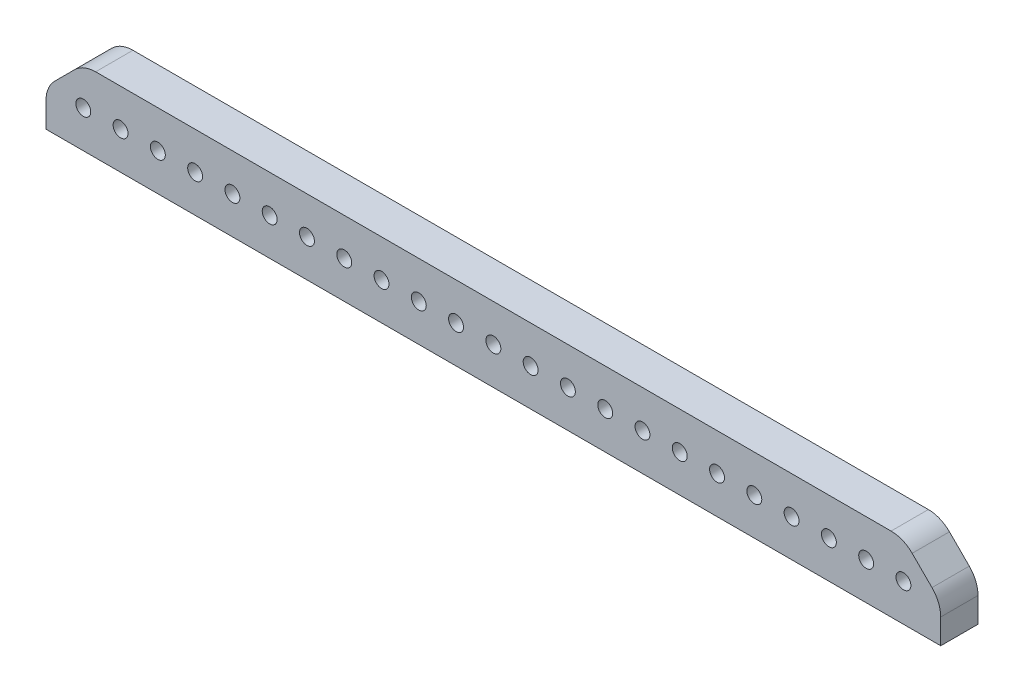
ISO-10303-21;
HEADER;
FILE_DESCRIPTION(('STEP AP214'),'2;1');
FILE_NAME('part.step','',(''),(''),'','','');
FILE_SCHEMA(('AUTOMOTIVE_DESIGN { 1 0 10303 214 1 1 1 1 }'));
ENDSEC;
DATA;
#1=APPLICATION_CONTEXT('core data for automotive mechanical design processes');
#2=APPLICATION_PROTOCOL_DEFINITION('international standard','automotive_design',2000,#1);
#3=PRODUCT_CONTEXT('',#1,'mechanical');
#4=PRODUCT('Part','Part','',(#3));
#5=PRODUCT_RELATED_PRODUCT_CATEGORY('part','',(#4));
#6=PRODUCT_DEFINITION_FORMATION('','',#4);
#7=PRODUCT_DEFINITION_CONTEXT('part definition',#1,'design');
#8=PRODUCT_DEFINITION('design','',#6,#7);
#9=PRODUCT_DEFINITION_SHAPE('','',#8);
#10=(LENGTH_UNIT() NAMED_UNIT(*) SI_UNIT(.MILLI.,.METRE.));
#11=(NAMED_UNIT(*) PLANE_ANGLE_UNIT() SI_UNIT($,.RADIAN.));
#12=(NAMED_UNIT(*) SI_UNIT($,.STERADIAN.) SOLID_ANGLE_UNIT());
#13=UNCERTAINTY_MEASURE_WITH_UNIT(LENGTH_MEASURE(1.E-05),#10,'distance_accuracy_value','');
#14=(GEOMETRIC_REPRESENTATION_CONTEXT(3) GLOBAL_UNCERTAINTY_ASSIGNED_CONTEXT((#13)) GLOBAL_UNIT_ASSIGNED_CONTEXT((#10,
#11,#12)) REPRESENTATION_CONTEXT('',''));
#15=CARTESIAN_POINT('',(0.,0.,0.));
#16=DIRECTION('',(0.,0.,1.));
#17=DIRECTION('',(1.,0.,0.));
#18=AXIS2_PLACEMENT_3D('',#15,#16,#17);
#19=CARTESIAN_POINT('',(76.2,-6.35,6.35));
#20=DIRECTION('',(-1.,0.,0.));
#21=DIRECTION('',(0.,0.,1.));
#22=AXIS2_PLACEMENT_3D('',#19,#20,#21);
#23=PLANE('',#22);
#24=DIRECTION('',(0.,1.,0.));
#25=VECTOR('',#24,1.);
#26=CARTESIAN_POINT('',(76.2,-6.35,0.));
#27=LINE('',#26,#25);
#28=CARTESIAN_POINT('',(76.2,-6.35,0.));
#29=VERTEX_POINT('',#28);
#30=CARTESIAN_POINT('',(76.2,-2.10420489685533,0.));
#31=VERTEX_POINT('',#30);
#32=EDGE_CURVE('E143',#29,#31,#27,.T.);
#33=ORIENTED_EDGE('',*,*,#32,.T.);
#34=DIRECTION('',(0.,0.,-1.));
#35=VECTOR('',#34,1.);
#36=CARTESIAN_POINT('',(76.2,-2.10420489685533,6.35));
#37=LINE('',#36,#35);
#38=CARTESIAN_POINT('',(76.2,-2.10420489685533,6.35));
#39=VERTEX_POINT('',#38);
#40=EDGE_CURVE('E11',#31,#39,#37,.F.);
#41=ORIENTED_EDGE('',*,*,#40,.T.);
#42=DIRECTION('',(0.,1.,0.));
#43=VECTOR('',#42,1.);
#44=CARTESIAN_POINT('',(76.2,-6.35,6.35));
#45=LINE('',#44,#43);
#46=CARTESIAN_POINT('',(76.2,-6.35,6.35));
#47=VERTEX_POINT('',#46);
#48=EDGE_CURVE('E151',#47,#39,#45,.T.);
#49=ORIENTED_EDGE('',*,*,#48,.F.);
#50=DIRECTION('',(0.,0.,-1.));
#51=VECTOR('',#50,1.);
#52=CARTESIAN_POINT('',(76.2,-6.35,6.35));
#53=LINE('',#52,#51);
#54=EDGE_CURVE('E134',#47,#29,#53,.T.);
#55=ORIENTED_EDGE('',*,*,#54,.T.);
#56=EDGE_LOOP('',(#33,#41,#49,#55));
#57=FACE_BOUND('',#56,.T.);
#58=ADVANCED_FACE('F33',(#57),#23,.F.);
#59=CARTESIAN_POINT('',(-76.2,6.35,6.35));
#60=DIRECTION('',(0.,-1.,0.));
#61=DIRECTION('',(0.,0.,-1.));
#62=AXIS2_PLACEMENT_3D('',#59,#60,#61);
#63=PLANE('',#62);
#64=DIRECTION('',(-1.,0.,0.));
#65=VECTOR('',#64,1.);
#66=CARTESIAN_POINT('',(-76.2,6.35,0.));
#67=LINE('',#66,#65);
#68=CARTESIAN_POINT('',(67.7457951031446,6.35,0.));
#69=VERTEX_POINT('',#68);
#70=CARTESIAN_POINT('',(-67.7457951031447,6.35,0.));
#71=VERTEX_POINT('',#70);
#72=EDGE_CURVE('E145',#69,#71,#67,.T.);
#73=ORIENTED_EDGE('',*,*,#72,.T.);
#74=DIRECTION('',(0.,0.,-1.));
#75=VECTOR('',#74,1.);
#76=CARTESIAN_POINT('',(-67.7457951031447,6.35,6.35));
#77=LINE('',#76,#75);
#78=CARTESIAN_POINT('',(-67.7457951031447,6.35,6.35));
#79=VERTEX_POINT('',#78);
#80=EDGE_CURVE('E165',#71,#79,#77,.F.);
#81=ORIENTED_EDGE('',*,*,#80,.T.);
#82=DIRECTION('',(-1.,0.,0.));
#83=VECTOR('',#82,1.);
#84=CARTESIAN_POINT('',(-76.2,6.35,6.35));
#85=LINE('',#84,#83);
#86=CARTESIAN_POINT('',(67.7457951031446,6.35,6.35));
#87=VERTEX_POINT('',#86);
#88=EDGE_CURVE('E124',#87,#79,#85,.T.);
#89=ORIENTED_EDGE('',*,*,#88,.F.);
#90=DIRECTION('',(0.,0.,1.));
#91=VECTOR('',#90,1.);
#92=CARTESIAN_POINT('',(67.7457951031447,6.35,0.));
#93=LINE('',#92,#91);
#94=EDGE_CURVE('E162',#87,#69,#93,.F.);
#95=ORIENTED_EDGE('',*,*,#94,.T.);
#96=EDGE_LOOP('',(#73,#81,#89,#95));
#97=FACE_BOUND('',#96,.T.);
#98=ADVANCED_FACE('F201',(#97),#63,.F.);
#99=CARTESIAN_POINT('',(-76.2,-6.35,6.35));
#100=DIRECTION('',(1.,0.,0.));
#101=DIRECTION('',(0.,0.,-1.));
#102=AXIS2_PLACEMENT_3D('',#99,#100,#101);
#103=PLANE('',#102);
#104=DIRECTION('',(0.,-1.,0.));
#105=VECTOR('',#104,1.);
#106=CARTESIAN_POINT('',(-76.2,-6.35,6.35));
#107=LINE('',#106,#105);
#108=CARTESIAN_POINT('',(-76.2,-2.10420489685532,6.35));
#109=VERTEX_POINT('',#108);
#110=CARTESIAN_POINT('',(-76.2,-6.35,6.35));
#111=VERTEX_POINT('',#110);
#112=EDGE_CURVE('E112',#109,#111,#107,.T.);
#113=ORIENTED_EDGE('',*,*,#112,.F.);
#114=DIRECTION('',(0.,0.,1.));
#115=VECTOR('',#114,1.);
#116=CARTESIAN_POINT('',(-76.2,-2.10420489685532,0.));
#117=LINE('',#116,#115);
#118=CARTESIAN_POINT('',(-76.2,-2.10420489685532,0.));
#119=VERTEX_POINT('',#118);
#120=EDGE_CURVE('E185',#109,#119,#117,.F.);
#121=ORIENTED_EDGE('',*,*,#120,.T.);
#122=DIRECTION('',(0.,-1.,0.));
#123=VECTOR('',#122,1.);
#124=CARTESIAN_POINT('',(-76.2,-6.35,0.));
#125=LINE('',#124,#123);
#126=CARTESIAN_POINT('',(-76.2,-6.35,0.));
#127=VERTEX_POINT('',#126);
#128=EDGE_CURVE('E130',#119,#127,#125,.T.);
#129=ORIENTED_EDGE('',*,*,#128,.T.);
#130=DIRECTION('',(0.,0.,-1.));
#131=VECTOR('',#130,1.);
#132=CARTESIAN_POINT('',(-76.2,-6.35,6.35));
#133=LINE('',#132,#131);
#134=EDGE_CURVE('E127',#111,#127,#133,.T.);
#135=ORIENTED_EDGE('',*,*,#134,.F.);
#136=EDGE_LOOP('',(#113,#121,#129,#135));
#137=FACE_BOUND('',#136,.T.);
#138=ADVANCED_FACE('F128',(#137),#103,.F.);
#139=CARTESIAN_POINT('',(-76.2,-6.35,6.35));
#140=DIRECTION('',(0.,1.,0.));
#141=DIRECTION('',(0.,0.,1.));
#142=AXIS2_PLACEMENT_3D('',#139,#140,#141);
#143=PLANE('',#142);
#144=DIRECTION('',(1.,0.,0.));
#145=VECTOR('',#144,1.);
#146=CARTESIAN_POINT('',(-76.2,-6.35,0.));
#147=LINE('',#146,#145);
#148=EDGE_CURVE('E150',#127,#29,#147,.T.);
#149=ORIENTED_EDGE('',*,*,#148,.T.);
#150=ORIENTED_EDGE('',*,*,#54,.F.);
#151=DIRECTION('',(1.,0.,0.));
#152=VECTOR('',#151,1.);
#153=CARTESIAN_POINT('',(-76.2,-6.35,6.35));
#154=LINE('',#153,#152);
#155=EDGE_CURVE('E118',#111,#47,#154,.T.);
#156=ORIENTED_EDGE('',*,*,#155,.F.);
#157=ORIENTED_EDGE('',*,*,#134,.T.);
#158=EDGE_LOOP('',(#149,#150,#156,#157));
#159=FACE_BOUND('',#158,.T.);
#160=ADVANCED_FACE('F136',(#159),#143,.F.);
#161=CARTESIAN_POINT('',(0.,0.,6.35));
#162=DIRECTION('',(0.,0.,-1.));
#163=DIRECTION('',(-1.,0.,0.));
#164=AXIS2_PLACEMENT_3D('',#161,#162,#163);
#165=PLANE('',#164);
#166=CARTESIAN_POINT('',(69.85,0.,6.35));
#167=DIRECTION('',(0.,0.,1.));
#168=DIRECTION('',(1.,0.,0.));
#169=AXIS2_PLACEMENT_3D('',#166,#167,#168);
#170=CIRCLE('',#169,1.27);
#171=CARTESIAN_POINT('',(71.12,0.,6.35));
#172=VERTEX_POINT('',#171);
#173=EDGE_CURVE('E344',#172,#172,#170,.T.);
#174=ORIENTED_EDGE('',*,*,#173,.F.);
#175=EDGE_LOOP('',(#174));
#176=FACE_BOUND('',#175,.T.);
#177=CARTESIAN_POINT('',(63.5,0.,6.35));
#178=DIRECTION('',(0.,0.,1.));
#179=DIRECTION('',(1.,0.,0.));
#180=AXIS2_PLACEMENT_3D('',#177,#178,#179);
#181=CIRCLE('',#180,1.27);
#182=CARTESIAN_POINT('',(64.77,0.,6.35));
#183=VERTEX_POINT('',#182);
#184=EDGE_CURVE('E338',#183,#183,#181,.T.);
#185=ORIENTED_EDGE('',*,*,#184,.F.);
#186=EDGE_LOOP('',(#185));
#187=FACE_BOUND('',#186,.T.);
#188=CARTESIAN_POINT('',(57.15,0.,6.35));
#189=DIRECTION('',(0.,0.,1.));
#190=DIRECTION('',(1.,0.,0.));
#191=AXIS2_PLACEMENT_3D('',#188,#189,#190);
#192=CIRCLE('',#191,1.27);
#193=CARTESIAN_POINT('',(58.42,0.,6.35));
#194=VERTEX_POINT('',#193);
#195=EDGE_CURVE('E332',#194,#194,#192,.T.);
#196=ORIENTED_EDGE('',*,*,#195,.F.);
#197=EDGE_LOOP('',(#196));
#198=FACE_BOUND('',#197,.T.);
#199=CARTESIAN_POINT('',(50.8,0.,6.35));
#200=DIRECTION('',(0.,0.,1.));
#201=DIRECTION('',(1.,0.,0.));
#202=AXIS2_PLACEMENT_3D('',#199,#200,#201);
#203=CIRCLE('',#202,1.27);
#204=CARTESIAN_POINT('',(52.07,0.,6.35));
#205=VERTEX_POINT('',#204);
#206=EDGE_CURVE('E326',#205,#205,#203,.T.);
#207=ORIENTED_EDGE('',*,*,#206,.F.);
#208=EDGE_LOOP('',(#207));
#209=FACE_BOUND('',#208,.T.);
#210=CARTESIAN_POINT('',(44.45,0.,6.35));
#211=DIRECTION('',(0.,0.,1.));
#212=DIRECTION('',(1.,0.,0.));
#213=AXIS2_PLACEMENT_3D('',#210,#211,#212);
#214=CIRCLE('',#213,1.27);
#215=CARTESIAN_POINT('',(45.72,0.,6.35));
#216=VERTEX_POINT('',#215);
#217=EDGE_CURVE('E320',#216,#216,#214,.T.);
#218=ORIENTED_EDGE('',*,*,#217,.F.);
#219=EDGE_LOOP('',(#218));
#220=FACE_BOUND('',#219,.T.);
#221=CARTESIAN_POINT('',(38.1,0.,6.35));
#222=DIRECTION('',(0.,0.,1.));
#223=DIRECTION('',(1.,0.,0.));
#224=AXIS2_PLACEMENT_3D('',#221,#222,#223);
#225=CIRCLE('',#224,1.27);
#226=CARTESIAN_POINT('',(39.37,0.,6.35));
#227=VERTEX_POINT('',#226);
#228=EDGE_CURVE('E314',#227,#227,#225,.T.);
#229=ORIENTED_EDGE('',*,*,#228,.F.);
#230=EDGE_LOOP('',(#229));
#231=FACE_BOUND('',#230,.T.);
#232=CARTESIAN_POINT('',(31.75,0.,6.35));
#233=DIRECTION('',(0.,0.,1.));
#234=DIRECTION('',(1.,0.,0.));
#235=AXIS2_PLACEMENT_3D('',#232,#233,#234);
#236=CIRCLE('',#235,1.27);
#237=CARTESIAN_POINT('',(33.02,0.,6.35));
#238=VERTEX_POINT('',#237);
#239=EDGE_CURVE('E308',#238,#238,#236,.T.);
#240=ORIENTED_EDGE('',*,*,#239,.F.);
#241=EDGE_LOOP('',(#240));
#242=FACE_BOUND('',#241,.T.);
#243=CARTESIAN_POINT('',(25.4,0.,6.35));
#244=DIRECTION('',(0.,0.,1.));
#245=DIRECTION('',(1.,0.,0.));
#246=AXIS2_PLACEMENT_3D('',#243,#244,#245);
#247=CIRCLE('',#246,1.27);
#248=CARTESIAN_POINT('',(26.67,0.,6.35));
#249=VERTEX_POINT('',#248);
#250=EDGE_CURVE('E302',#249,#249,#247,.T.);
#251=ORIENTED_EDGE('',*,*,#250,.F.);
#252=EDGE_LOOP('',(#251));
#253=FACE_BOUND('',#252,.T.);
#254=CARTESIAN_POINT('',(19.05,0.,6.35));
#255=DIRECTION('',(0.,0.,1.));
#256=DIRECTION('',(1.,0.,0.));
#257=AXIS2_PLACEMENT_3D('',#254,#255,#256);
#258=CIRCLE('',#257,1.27);
#259=CARTESIAN_POINT('',(20.32,0.,6.35));
#260=VERTEX_POINT('',#259);
#261=EDGE_CURVE('E296',#260,#260,#258,.T.);
#262=ORIENTED_EDGE('',*,*,#261,.F.);
#263=EDGE_LOOP('',(#262));
#264=FACE_BOUND('',#263,.T.);
#265=CARTESIAN_POINT('',(12.7,0.,6.35));
#266=DIRECTION('',(0.,0.,1.));
#267=DIRECTION('',(1.,0.,0.));
#268=AXIS2_PLACEMENT_3D('',#265,#266,#267);
#269=CIRCLE('',#268,1.27);
#270=CARTESIAN_POINT('',(13.97,0.,6.35));
#271=VERTEX_POINT('',#270);
#272=EDGE_CURVE('E290',#271,#271,#269,.T.);
#273=ORIENTED_EDGE('',*,*,#272,.F.);
#274=EDGE_LOOP('',(#273));
#275=FACE_BOUND('',#274,.T.);
#276=CARTESIAN_POINT('',(6.35,0.,6.35));
#277=DIRECTION('',(0.,0.,1.));
#278=DIRECTION('',(1.,0.,0.));
#279=AXIS2_PLACEMENT_3D('',#276,#277,#278);
#280=CIRCLE('',#279,1.27);
#281=CARTESIAN_POINT('',(7.62,0.,6.35));
#282=VERTEX_POINT('',#281);
#283=EDGE_CURVE('E284',#282,#282,#280,.T.);
#284=ORIENTED_EDGE('',*,*,#283,.F.);
#285=EDGE_LOOP('',(#284));
#286=FACE_BOUND('',#285,.T.);
#287=CARTESIAN_POINT('',(-69.85,0.,6.35));
#288=DIRECTION('',(0.,0.,1.));
#289=DIRECTION('',(1.,0.,0.));
#290=AXIS2_PLACEMENT_3D('',#287,#288,#289);
#291=CIRCLE('',#290,1.27);
#292=CARTESIAN_POINT('',(-68.58,0.,6.35));
#293=VERTEX_POINT('',#292);
#294=EDGE_CURVE('E278',#293,#293,#291,.T.);
#295=ORIENTED_EDGE('',*,*,#294,.F.);
#296=EDGE_LOOP('',(#295));
#297=FACE_BOUND('',#296,.T.);
#298=CARTESIAN_POINT('',(-63.5,0.,6.35));
#299=DIRECTION('',(0.,0.,1.));
#300=DIRECTION('',(1.,0.,0.));
#301=AXIS2_PLACEMENT_3D('',#298,#299,#300);
#302=CIRCLE('',#301,1.27);
#303=CARTESIAN_POINT('',(-62.23,0.,6.35));
#304=VERTEX_POINT('',#303);
#305=EDGE_CURVE('E272',#304,#304,#302,.T.);
#306=ORIENTED_EDGE('',*,*,#305,.F.);
#307=EDGE_LOOP('',(#306));
#308=FACE_BOUND('',#307,.T.);
#309=CARTESIAN_POINT('',(-57.15,0.,6.35));
#310=DIRECTION('',(0.,0.,1.));
#311=DIRECTION('',(1.,0.,0.));
#312=AXIS2_PLACEMENT_3D('',#309,#310,#311);
#313=CIRCLE('',#312,1.27);
#314=CARTESIAN_POINT('',(-55.88,0.,6.35));
#315=VERTEX_POINT('',#314);
#316=EDGE_CURVE('E266',#315,#315,#313,.T.);
#317=ORIENTED_EDGE('',*,*,#316,.F.);
#318=EDGE_LOOP('',(#317));
#319=FACE_BOUND('',#318,.T.);
#320=CARTESIAN_POINT('',(-50.8,0.,6.35));
#321=DIRECTION('',(0.,0.,1.));
#322=DIRECTION('',(1.,0.,0.));
#323=AXIS2_PLACEMENT_3D('',#320,#321,#322);
#324=CIRCLE('',#323,1.27);
#325=CARTESIAN_POINT('',(-49.53,0.,6.35));
#326=VERTEX_POINT('',#325);
#327=EDGE_CURVE('E260',#326,#326,#324,.T.);
#328=ORIENTED_EDGE('',*,*,#327,.F.);
#329=EDGE_LOOP('',(#328));
#330=FACE_BOUND('',#329,.T.);
#331=CARTESIAN_POINT('',(-44.45,0.,6.35));
#332=DIRECTION('',(0.,0.,1.));
#333=DIRECTION('',(1.,0.,0.));
#334=AXIS2_PLACEMENT_3D('',#331,#332,#333);
#335=CIRCLE('',#334,1.27);
#336=CARTESIAN_POINT('',(-43.18,0.,6.35));
#337=VERTEX_POINT('',#336);
#338=EDGE_CURVE('E254',#337,#337,#335,.T.);
#339=ORIENTED_EDGE('',*,*,#338,.F.);
#340=EDGE_LOOP('',(#339));
#341=FACE_BOUND('',#340,.T.);
#342=CARTESIAN_POINT('',(-38.1,0.,6.35));
#343=DIRECTION('',(0.,0.,1.));
#344=DIRECTION('',(1.,0.,0.));
#345=AXIS2_PLACEMENT_3D('',#342,#343,#344);
#346=CIRCLE('',#345,1.27);
#347=CARTESIAN_POINT('',(-36.83,0.,6.35));
#348=VERTEX_POINT('',#347);
#349=EDGE_CURVE('E248',#348,#348,#346,.T.);
#350=ORIENTED_EDGE('',*,*,#349,.F.);
#351=EDGE_LOOP('',(#350));
#352=FACE_BOUND('',#351,.T.);
#353=CARTESIAN_POINT('',(-31.75,0.,6.35));
#354=DIRECTION('',(0.,0.,1.));
#355=DIRECTION('',(1.,0.,0.));
#356=AXIS2_PLACEMENT_3D('',#353,#354,#355);
#357=CIRCLE('',#356,1.27);
#358=CARTESIAN_POINT('',(-30.48,0.,6.35));
#359=VERTEX_POINT('',#358);
#360=EDGE_CURVE('E242',#359,#359,#357,.T.);
#361=ORIENTED_EDGE('',*,*,#360,.F.);
#362=EDGE_LOOP('',(#361));
#363=FACE_BOUND('',#362,.T.);
#364=CARTESIAN_POINT('',(-25.4,0.,6.35));
#365=DIRECTION('',(0.,0.,1.));
#366=DIRECTION('',(1.,0.,0.));
#367=AXIS2_PLACEMENT_3D('',#364,#365,#366);
#368=CIRCLE('',#367,1.27);
#369=CARTESIAN_POINT('',(-24.13,0.,6.35));
#370=VERTEX_POINT('',#369);
#371=EDGE_CURVE('E236',#370,#370,#368,.T.);
#372=ORIENTED_EDGE('',*,*,#371,.F.);
#373=EDGE_LOOP('',(#372));
#374=FACE_BOUND('',#373,.T.);
#375=CARTESIAN_POINT('',(-19.05,0.,6.35));
#376=DIRECTION('',(0.,0.,1.));
#377=DIRECTION('',(1.,0.,0.));
#378=AXIS2_PLACEMENT_3D('',#375,#376,#377);
#379=CIRCLE('',#378,1.27);
#380=CARTESIAN_POINT('',(-17.78,0.,6.35));
#381=VERTEX_POINT('',#380);
#382=EDGE_CURVE('E230',#381,#381,#379,.T.);
#383=ORIENTED_EDGE('',*,*,#382,.F.);
#384=EDGE_LOOP('',(#383));
#385=FACE_BOUND('',#384,.T.);
#386=CARTESIAN_POINT('',(-12.7,0.,6.35));
#387=DIRECTION('',(0.,0.,1.));
#388=DIRECTION('',(1.,0.,0.));
#389=AXIS2_PLACEMENT_3D('',#386,#387,#388);
#390=CIRCLE('',#389,1.27);
#391=CARTESIAN_POINT('',(-11.43,0.,6.35));
#392=VERTEX_POINT('',#391);
#393=EDGE_CURVE('E224',#392,#392,#390,.T.);
#394=ORIENTED_EDGE('',*,*,#393,.F.);
#395=EDGE_LOOP('',(#394));
#396=FACE_BOUND('',#395,.T.);
#397=CARTESIAN_POINT('',(-6.35,0.,6.35));
#398=DIRECTION('',(0.,0.,1.));
#399=DIRECTION('',(1.,0.,0.));
#400=AXIS2_PLACEMENT_3D('',#397,#398,#399);
#401=CIRCLE('',#400,1.27);
#402=CARTESIAN_POINT('',(-5.08,0.,6.35));
#403=VERTEX_POINT('',#402);
#404=EDGE_CURVE('E218',#403,#403,#401,.T.);
#405=ORIENTED_EDGE('',*,*,#404,.F.);
#406=EDGE_LOOP('',(#405));
#407=FACE_BOUND('',#406,.T.);
#408=CARTESIAN_POINT('',(0.,0.,6.35));
#409=DIRECTION('',(0.,0.,1.));
#410=DIRECTION('',(1.,0.,0.));
#411=AXIS2_PLACEMENT_3D('',#408,#409,#410);
#412=CIRCLE('',#411,1.27);
#413=CARTESIAN_POINT('',(1.27,0.,6.35));
#414=VERTEX_POINT('',#413);
#415=EDGE_CURVE('E212',#414,#414,#412,.T.);
#416=ORIENTED_EDGE('',*,*,#415,.F.);
#417=EDGE_LOOP('',(#416));
#418=FACE_BOUND('',#417,.T.);
#419=ORIENTED_EDGE('',*,*,#88,.T.);
#420=CARTESIAN_POINT('',(-67.7457951031447,1.27,6.35));
#421=DIRECTION('',(0.,0.,-1.));
#422=DIRECTION('',(-1.,0.,0.));
#423=AXIS2_PLACEMENT_3D('',#420,#421,#422);
#424=CIRCLE('',#423,5.08);
#425=CARTESIAN_POINT('',(-71.3378975515723,4.86210244842766,6.35));
#426=VERTEX_POINT('',#425);
#427=EDGE_CURVE('E173',#79,#426,#424,.F.);
#428=ORIENTED_EDGE('',*,*,#427,.T.);
#429=DIRECTION('',(0.707106781186548,0.707106781186547,0.));
#430=VECTOR('',#429,1.);
#431=CARTESIAN_POINT('',(-76.2,0.,6.35));
#432=LINE('',#431,#430);
#433=CARTESIAN_POINT('',(-74.7121024484277,1.48789755157235,6.35));
#434=VERTEX_POINT('',#433);
#435=EDGE_CURVE('E157',#426,#434,#432,.F.);
#436=ORIENTED_EDGE('',*,*,#435,.T.);
#437=CARTESIAN_POINT('',(-71.12,-2.10420489685532,6.35));
#438=DIRECTION('',(0.,0.,-1.));
#439=DIRECTION('',(-1.,0.,0.));
#440=AXIS2_PLACEMENT_3D('',#437,#438,#439);
#441=CIRCLE('',#440,5.08);
#442=EDGE_CURVE('E122',#434,#109,#441,.F.);
#443=ORIENTED_EDGE('',*,*,#442,.T.);
#444=ORIENTED_EDGE('',*,*,#112,.T.);
#445=ORIENTED_EDGE('',*,*,#155,.T.);
#446=ORIENTED_EDGE('',*,*,#48,.T.);
#447=CARTESIAN_POINT('',(71.12,-2.10420489685533,6.35));
#448=DIRECTION('',(0.,0.,-1.));
#449=DIRECTION('',(-1.,0.,0.));
#450=AXIS2_PLACEMENT_3D('',#447,#448,#449);
#451=CIRCLE('',#450,5.08);
#452=CARTESIAN_POINT('',(74.7121024484277,1.48789755157233,6.35));
#453=VERTEX_POINT('',#452);
#454=EDGE_CURVE('E168',#39,#453,#451,.F.);
#455=ORIENTED_EDGE('',*,*,#454,.T.);
#456=DIRECTION('',(0.707106781186547,-0.707106781186548,0.));
#457=VECTOR('',#456,1.);
#458=CARTESIAN_POINT('',(69.85,6.35,6.35));
#459=LINE('',#458,#457);
#460=CARTESIAN_POINT('',(71.3378975515723,4.86210244842766,6.35));
#461=VERTEX_POINT('',#460);
#462=EDGE_CURVE('E159',#453,#461,#459,.F.);
#463=ORIENTED_EDGE('',*,*,#462,.T.);
#464=CARTESIAN_POINT('',(67.7457951031447,1.27,6.35));
#465=DIRECTION('',(0.,0.,-1.));
#466=DIRECTION('',(-1.,0.,0.));
#467=AXIS2_PLACEMENT_3D('',#464,#465,#466);
#468=CIRCLE('',#467,5.08);
#469=EDGE_CURVE('E170',#461,#87,#468,.F.);
#470=ORIENTED_EDGE('',*,*,#469,.T.);
#471=EDGE_LOOP('',(#419,#428,#436,#443,#444,#445,#446,#455,#463,#470));
#472=FACE_BOUND('',#471,.T.);
#473=ADVANCED_FACE('F115',(#176,#187,#198,#209,#220,#231,#242,#253,#264,#275,#286,#297,#308,
#319,#330,#341,#352,#363,#374,#385,#396,#407,#418,#472),#165,.F.);
#474=CARTESIAN_POINT('',(0.,0.,0.));
#475=DIRECTION('',(0.,0.,-1.));
#476=DIRECTION('',(-1.,0.,0.));
#477=AXIS2_PLACEMENT_3D('',#474,#475,#476);
#478=PLANE('',#477);
#479=CARTESIAN_POINT('',(69.85,0.,0.));
#480=DIRECTION('',(0.,0.,1.));
#481=DIRECTION('',(1.,0.,0.));
#482=AXIS2_PLACEMENT_3D('',#479,#480,#481);
#483=CIRCLE('',#482,1.27);
#484=CARTESIAN_POINT('',(71.12,0.,0.));
#485=VERTEX_POINT('',#484);
#486=EDGE_CURVE('E341',#485,#485,#483,.T.);
#487=ORIENTED_EDGE('',*,*,#486,.T.);
#488=EDGE_LOOP('',(#487));
#489=FACE_BOUND('',#488,.T.);
#490=CARTESIAN_POINT('',(63.5,0.,0.));
#491=DIRECTION('',(0.,0.,1.));
#492=DIRECTION('',(1.,0.,0.));
#493=AXIS2_PLACEMENT_3D('',#490,#491,#492);
#494=CIRCLE('',#493,1.27);
#495=CARTESIAN_POINT('',(64.77,0.,0.));
#496=VERTEX_POINT('',#495);
#497=EDGE_CURVE('E335',#496,#496,#494,.T.);
#498=ORIENTED_EDGE('',*,*,#497,.T.);
#499=EDGE_LOOP('',(#498));
#500=FACE_BOUND('',#499,.T.);
#501=CARTESIAN_POINT('',(57.15,0.,0.));
#502=DIRECTION('',(0.,0.,1.));
#503=DIRECTION('',(1.,0.,0.));
#504=AXIS2_PLACEMENT_3D('',#501,#502,#503);
#505=CIRCLE('',#504,1.27);
#506=CARTESIAN_POINT('',(58.42,0.,0.));
#507=VERTEX_POINT('',#506);
#508=EDGE_CURVE('E329',#507,#507,#505,.T.);
#509=ORIENTED_EDGE('',*,*,#508,.T.);
#510=EDGE_LOOP('',(#509));
#511=FACE_BOUND('',#510,.T.);
#512=CARTESIAN_POINT('',(50.8,0.,0.));
#513=DIRECTION('',(0.,0.,1.));
#514=DIRECTION('',(1.,0.,0.));
#515=AXIS2_PLACEMENT_3D('',#512,#513,#514);
#516=CIRCLE('',#515,1.27);
#517=CARTESIAN_POINT('',(52.07,0.,0.));
#518=VERTEX_POINT('',#517);
#519=EDGE_CURVE('E323',#518,#518,#516,.T.);
#520=ORIENTED_EDGE('',*,*,#519,.T.);
#521=EDGE_LOOP('',(#520));
#522=FACE_BOUND('',#521,.T.);
#523=CARTESIAN_POINT('',(44.45,0.,0.));
#524=DIRECTION('',(0.,0.,1.));
#525=DIRECTION('',(1.,0.,0.));
#526=AXIS2_PLACEMENT_3D('',#523,#524,#525);
#527=CIRCLE('',#526,1.27);
#528=CARTESIAN_POINT('',(45.72,0.,0.));
#529=VERTEX_POINT('',#528);
#530=EDGE_CURVE('E317',#529,#529,#527,.T.);
#531=ORIENTED_EDGE('',*,*,#530,.T.);
#532=EDGE_LOOP('',(#531));
#533=FACE_BOUND('',#532,.T.);
#534=CARTESIAN_POINT('',(38.1,0.,0.));
#535=DIRECTION('',(0.,0.,1.));
#536=DIRECTION('',(1.,0.,0.));
#537=AXIS2_PLACEMENT_3D('',#534,#535,#536);
#538=CIRCLE('',#537,1.27);
#539=CARTESIAN_POINT('',(39.37,0.,0.));
#540=VERTEX_POINT('',#539);
#541=EDGE_CURVE('E311',#540,#540,#538,.T.);
#542=ORIENTED_EDGE('',*,*,#541,.T.);
#543=EDGE_LOOP('',(#542));
#544=FACE_BOUND('',#543,.T.);
#545=CARTESIAN_POINT('',(31.75,0.,0.));
#546=DIRECTION('',(0.,0.,1.));
#547=DIRECTION('',(1.,0.,0.));
#548=AXIS2_PLACEMENT_3D('',#545,#546,#547);
#549=CIRCLE('',#548,1.27);
#550=CARTESIAN_POINT('',(33.02,0.,0.));
#551=VERTEX_POINT('',#550);
#552=EDGE_CURVE('E305',#551,#551,#549,.T.);
#553=ORIENTED_EDGE('',*,*,#552,.T.);
#554=EDGE_LOOP('',(#553));
#555=FACE_BOUND('',#554,.T.);
#556=CARTESIAN_POINT('',(25.4,0.,0.));
#557=DIRECTION('',(0.,0.,1.));
#558=DIRECTION('',(1.,0.,0.));
#559=AXIS2_PLACEMENT_3D('',#556,#557,#558);
#560=CIRCLE('',#559,1.27);
#561=CARTESIAN_POINT('',(26.67,0.,0.));
#562=VERTEX_POINT('',#561);
#563=EDGE_CURVE('E299',#562,#562,#560,.T.);
#564=ORIENTED_EDGE('',*,*,#563,.T.);
#565=EDGE_LOOP('',(#564));
#566=FACE_BOUND('',#565,.T.);
#567=CARTESIAN_POINT('',(19.05,0.,0.));
#568=DIRECTION('',(0.,0.,1.));
#569=DIRECTION('',(1.,0.,0.));
#570=AXIS2_PLACEMENT_3D('',#567,#568,#569);
#571=CIRCLE('',#570,1.27);
#572=CARTESIAN_POINT('',(20.32,0.,0.));
#573=VERTEX_POINT('',#572);
#574=EDGE_CURVE('E293',#573,#573,#571,.T.);
#575=ORIENTED_EDGE('',*,*,#574,.T.);
#576=EDGE_LOOP('',(#575));
#577=FACE_BOUND('',#576,.T.);
#578=CARTESIAN_POINT('',(12.7,0.,0.));
#579=DIRECTION('',(0.,0.,1.));
#580=DIRECTION('',(1.,0.,0.));
#581=AXIS2_PLACEMENT_3D('',#578,#579,#580);
#582=CIRCLE('',#581,1.27);
#583=CARTESIAN_POINT('',(13.97,0.,0.));
#584=VERTEX_POINT('',#583);
#585=EDGE_CURVE('E287',#584,#584,#582,.T.);
#586=ORIENTED_EDGE('',*,*,#585,.T.);
#587=EDGE_LOOP('',(#586));
#588=FACE_BOUND('',#587,.T.);
#589=CARTESIAN_POINT('',(6.35,0.,0.));
#590=DIRECTION('',(0.,0.,1.));
#591=DIRECTION('',(1.,0.,0.));
#592=AXIS2_PLACEMENT_3D('',#589,#590,#591);
#593=CIRCLE('',#592,1.27);
#594=CARTESIAN_POINT('',(7.62,0.,0.));
#595=VERTEX_POINT('',#594);
#596=EDGE_CURVE('E281',#595,#595,#593,.T.);
#597=ORIENTED_EDGE('',*,*,#596,.T.);
#598=EDGE_LOOP('',(#597));
#599=FACE_BOUND('',#598,.T.);
#600=CARTESIAN_POINT('',(-69.85,0.,0.));
#601=DIRECTION('',(0.,0.,1.));
#602=DIRECTION('',(1.,0.,0.));
#603=AXIS2_PLACEMENT_3D('',#600,#601,#602);
#604=CIRCLE('',#603,1.27);
#605=CARTESIAN_POINT('',(-68.58,0.,0.));
#606=VERTEX_POINT('',#605);
#607=EDGE_CURVE('E275',#606,#606,#604,.T.);
#608=ORIENTED_EDGE('',*,*,#607,.T.);
#609=EDGE_LOOP('',(#608));
#610=FACE_BOUND('',#609,.T.);
#611=CARTESIAN_POINT('',(-63.5,0.,0.));
#612=DIRECTION('',(0.,0.,1.));
#613=DIRECTION('',(1.,0.,0.));
#614=AXIS2_PLACEMENT_3D('',#611,#612,#613);
#615=CIRCLE('',#614,1.27);
#616=CARTESIAN_POINT('',(-62.23,0.,0.));
#617=VERTEX_POINT('',#616);
#618=EDGE_CURVE('E269',#617,#617,#615,.T.);
#619=ORIENTED_EDGE('',*,*,#618,.T.);
#620=EDGE_LOOP('',(#619));
#621=FACE_BOUND('',#620,.T.);
#622=CARTESIAN_POINT('',(-57.15,0.,0.));
#623=DIRECTION('',(0.,0.,1.));
#624=DIRECTION('',(1.,0.,0.));
#625=AXIS2_PLACEMENT_3D('',#622,#623,#624);
#626=CIRCLE('',#625,1.27);
#627=CARTESIAN_POINT('',(-55.88,0.,0.));
#628=VERTEX_POINT('',#627);
#629=EDGE_CURVE('E263',#628,#628,#626,.T.);
#630=ORIENTED_EDGE('',*,*,#629,.T.);
#631=EDGE_LOOP('',(#630));
#632=FACE_BOUND('',#631,.T.);
#633=CARTESIAN_POINT('',(-50.8,0.,0.));
#634=DIRECTION('',(0.,0.,1.));
#635=DIRECTION('',(1.,0.,0.));
#636=AXIS2_PLACEMENT_3D('',#633,#634,#635);
#637=CIRCLE('',#636,1.27);
#638=CARTESIAN_POINT('',(-49.53,0.,0.));
#639=VERTEX_POINT('',#638);
#640=EDGE_CURVE('E257',#639,#639,#637,.T.);
#641=ORIENTED_EDGE('',*,*,#640,.T.);
#642=EDGE_LOOP('',(#641));
#643=FACE_BOUND('',#642,.T.);
#644=CARTESIAN_POINT('',(-44.45,0.,0.));
#645=DIRECTION('',(0.,0.,1.));
#646=DIRECTION('',(1.,0.,0.));
#647=AXIS2_PLACEMENT_3D('',#644,#645,#646);
#648=CIRCLE('',#647,1.27);
#649=CARTESIAN_POINT('',(-43.18,0.,0.));
#650=VERTEX_POINT('',#649);
#651=EDGE_CURVE('E251',#650,#650,#648,.T.);
#652=ORIENTED_EDGE('',*,*,#651,.T.);
#653=EDGE_LOOP('',(#652));
#654=FACE_BOUND('',#653,.T.);
#655=CARTESIAN_POINT('',(-38.1,0.,0.));
#656=DIRECTION('',(0.,0.,1.));
#657=DIRECTION('',(1.,0.,0.));
#658=AXIS2_PLACEMENT_3D('',#655,#656,#657);
#659=CIRCLE('',#658,1.27);
#660=CARTESIAN_POINT('',(-36.83,0.,0.));
#661=VERTEX_POINT('',#660);
#662=EDGE_CURVE('E245',#661,#661,#659,.T.);
#663=ORIENTED_EDGE('',*,*,#662,.T.);
#664=EDGE_LOOP('',(#663));
#665=FACE_BOUND('',#664,.T.);
#666=CARTESIAN_POINT('',(-31.75,0.,0.));
#667=DIRECTION('',(0.,0.,1.));
#668=DIRECTION('',(1.,0.,0.));
#669=AXIS2_PLACEMENT_3D('',#666,#667,#668);
#670=CIRCLE('',#669,1.27);
#671=CARTESIAN_POINT('',(-30.48,0.,0.));
#672=VERTEX_POINT('',#671);
#673=EDGE_CURVE('E239',#672,#672,#670,.T.);
#674=ORIENTED_EDGE('',*,*,#673,.T.);
#675=EDGE_LOOP('',(#674));
#676=FACE_BOUND('',#675,.T.);
#677=CARTESIAN_POINT('',(-25.4,0.,0.));
#678=DIRECTION('',(0.,0.,1.));
#679=DIRECTION('',(1.,0.,0.));
#680=AXIS2_PLACEMENT_3D('',#677,#678,#679);
#681=CIRCLE('',#680,1.27);
#682=CARTESIAN_POINT('',(-24.13,0.,0.));
#683=VERTEX_POINT('',#682);
#684=EDGE_CURVE('E233',#683,#683,#681,.T.);
#685=ORIENTED_EDGE('',*,*,#684,.T.);
#686=EDGE_LOOP('',(#685));
#687=FACE_BOUND('',#686,.T.);
#688=CARTESIAN_POINT('',(-19.05,0.,0.));
#689=DIRECTION('',(0.,0.,1.));
#690=DIRECTION('',(1.,0.,0.));
#691=AXIS2_PLACEMENT_3D('',#688,#689,#690);
#692=CIRCLE('',#691,1.27);
#693=CARTESIAN_POINT('',(-17.78,0.,0.));
#694=VERTEX_POINT('',#693);
#695=EDGE_CURVE('E227',#694,#694,#692,.T.);
#696=ORIENTED_EDGE('',*,*,#695,.T.);
#697=EDGE_LOOP('',(#696));
#698=FACE_BOUND('',#697,.T.);
#699=CARTESIAN_POINT('',(-12.7,0.,0.));
#700=DIRECTION('',(0.,0.,1.));
#701=DIRECTION('',(1.,0.,0.));
#702=AXIS2_PLACEMENT_3D('',#699,#700,#701);
#703=CIRCLE('',#702,1.27);
#704=CARTESIAN_POINT('',(-11.43,0.,0.));
#705=VERTEX_POINT('',#704);
#706=EDGE_CURVE('E221',#705,#705,#703,.T.);
#707=ORIENTED_EDGE('',*,*,#706,.T.);
#708=EDGE_LOOP('',(#707));
#709=FACE_BOUND('',#708,.T.);
#710=CARTESIAN_POINT('',(-6.35,0.,0.));
#711=DIRECTION('',(0.,0.,1.));
#712=DIRECTION('',(1.,0.,0.));
#713=AXIS2_PLACEMENT_3D('',#710,#711,#712);
#714=CIRCLE('',#713,1.27);
#715=CARTESIAN_POINT('',(-5.08,0.,0.));
#716=VERTEX_POINT('',#715);
#717=EDGE_CURVE('E215',#716,#716,#714,.T.);
#718=ORIENTED_EDGE('',*,*,#717,.T.);
#719=EDGE_LOOP('',(#718));
#720=FACE_BOUND('',#719,.T.);
#721=CARTESIAN_POINT('',(0.,0.,0.));
#722=DIRECTION('',(0.,0.,1.));
#723=DIRECTION('',(1.,0.,0.));
#724=AXIS2_PLACEMENT_3D('',#721,#722,#723);
#725=CIRCLE('',#724,1.27);
#726=CARTESIAN_POINT('',(1.27,0.,0.));
#727=VERTEX_POINT('',#726);
#728=EDGE_CURVE('E146',#727,#727,#725,.T.);
#729=ORIENTED_EDGE('',*,*,#728,.T.);
#730=EDGE_LOOP('',(#729));
#731=FACE_BOUND('',#730,.T.);
#732=DIRECTION('',(-0.707106781186548,-0.707106781186547,0.));
#733=VECTOR('',#732,1.);
#734=CARTESIAN_POINT('',(-38.0999999999999,38.1,0.));
#735=LINE('',#734,#733);
#736=CARTESIAN_POINT('',(-74.7121024484277,1.48789755157234,0.));
#737=VERTEX_POINT('',#736);
#738=CARTESIAN_POINT('',(-71.3378975515724,4.86210244842765,0.));
#739=VERTEX_POINT('',#738);
#740=EDGE_CURVE('E133',#737,#739,#735,.F.);
#741=ORIENTED_EDGE('',*,*,#740,.T.);
#742=CARTESIAN_POINT('',(-67.7457951031447,1.27,0.));
#743=DIRECTION('',(0.,0.,-1.));
#744=DIRECTION('',(-1.,0.,0.));
#745=AXIS2_PLACEMENT_3D('',#742,#743,#744);
#746=CIRCLE('',#745,5.08);
#747=EDGE_CURVE('E183',#739,#71,#746,.T.);
#748=ORIENTED_EDGE('',*,*,#747,.T.);
#749=ORIENTED_EDGE('',*,*,#72,.F.);
#750=CARTESIAN_POINT('',(67.7457951031447,1.27,0.));
#751=DIRECTION('',(0.,0.,-1.));
#752=DIRECTION('',(-1.,0.,0.));
#753=AXIS2_PLACEMENT_3D('',#750,#751,#752);
#754=CIRCLE('',#753,5.08);
#755=CARTESIAN_POINT('',(71.3378975515724,4.86210244842766,0.));
#756=VERTEX_POINT('',#755);
#757=EDGE_CURVE('E180',#69,#756,#754,.T.);
#758=ORIENTED_EDGE('',*,*,#757,.T.);
#759=DIRECTION('',(-0.707106781186547,0.707106781186548,0.));
#760=VECTOR('',#759,1.);
#761=CARTESIAN_POINT('',(38.1000000000001,38.1,0.));
#762=LINE('',#761,#760);
#763=CARTESIAN_POINT('',(74.7121024484277,1.48789755157233,0.));
#764=VERTEX_POINT('',#763);
#765=EDGE_CURVE('E155',#756,#764,#762,.F.);
#766=ORIENTED_EDGE('',*,*,#765,.T.);
#767=CARTESIAN_POINT('',(71.12,-2.10420489685533,0.));
#768=DIRECTION('',(0.,0.,-1.));
#769=DIRECTION('',(-1.,0.,0.));
#770=AXIS2_PLACEMENT_3D('',#767,#768,#769);
#771=CIRCLE('',#770,5.08);
#772=EDGE_CURVE('E56',#764,#31,#771,.T.);
#773=ORIENTED_EDGE('',*,*,#772,.T.);
#774=ORIENTED_EDGE('',*,*,#32,.F.);
#775=ORIENTED_EDGE('',*,*,#148,.F.);
#776=ORIENTED_EDGE('',*,*,#128,.F.);
#777=CARTESIAN_POINT('',(-71.12,-2.10420489685532,0.));
#778=DIRECTION('',(0.,0.,-1.));
#779=DIRECTION('',(-1.,0.,0.));
#780=AXIS2_PLACEMENT_3D('',#777,#778,#779);
#781=CIRCLE('',#780,5.08);
#782=EDGE_CURVE('E48',#119,#737,#781,.T.);
#783=ORIENTED_EDGE('',*,*,#782,.T.);
#784=EDGE_LOOP('',(#741,#748,#749,#758,#766,#773,#774,#775,#776,#783));
#785=FACE_BOUND('',#784,.T.);
#786=ADVANCED_FACE('F203',(#489,#500,#511,#522,#533,#544,#555,#566,#577,#588,#599,#610,#621,
#632,#643,#654,#665,#676,#687,#698,#709,#720,#731,#785),#478,.T.);
#787=CARTESIAN_POINT('',(0.,0.,0.));
#788=DIRECTION('',(0.,0.,1.));
#789=DIRECTION('',(1.,0.,0.));
#790=AXIS2_PLACEMENT_3D('',#787,#788,#789);
#791=CYLINDRICAL_SURFACE('',#790,1.27);
#792=ORIENTED_EDGE('',*,*,#728,.F.);
#793=EDGE_LOOP('',(#792));
#794=FACE_BOUND('',#793,.T.);
#795=ORIENTED_EDGE('',*,*,#415,.T.);
#796=EDGE_LOOP('',(#795));
#797=FACE_BOUND('',#796,.T.);
#798=ADVANCED_FACE('F406',(#794,#797),#791,.F.);
#799=CARTESIAN_POINT('',(-6.35,0.,0.));
#800=DIRECTION('',(0.,0.,1.));
#801=DIRECTION('',(1.,0.,0.));
#802=AXIS2_PLACEMENT_3D('',#799,#800,#801);
#803=CYLINDRICAL_SURFACE('',#802,1.27);
#804=ORIENTED_EDGE('',*,*,#717,.F.);
#805=EDGE_LOOP('',(#804));
#806=FACE_BOUND('',#805,.T.);
#807=ORIENTED_EDGE('',*,*,#404,.T.);
#808=EDGE_LOOP('',(#807));
#809=FACE_BOUND('',#808,.T.);
#810=ADVANCED_FACE('F408',(#806,#809),#803,.F.);
#811=CARTESIAN_POINT('',(-12.7,0.,0.));
#812=DIRECTION('',(0.,0.,1.));
#813=DIRECTION('',(1.,0.,0.));
#814=AXIS2_PLACEMENT_3D('',#811,#812,#813);
#815=CYLINDRICAL_SURFACE('',#814,1.27);
#816=ORIENTED_EDGE('',*,*,#706,.F.);
#817=EDGE_LOOP('',(#816));
#818=FACE_BOUND('',#817,.T.);
#819=ORIENTED_EDGE('',*,*,#393,.T.);
#820=EDGE_LOOP('',(#819));
#821=FACE_BOUND('',#820,.T.);
#822=ADVANCED_FACE('F415',(#818,#821),#815,.F.);
#823=CARTESIAN_POINT('',(-19.05,0.,0.));
#824=DIRECTION('',(0.,0.,1.));
#825=DIRECTION('',(1.,0.,0.));
#826=AXIS2_PLACEMENT_3D('',#823,#824,#825);
#827=CYLINDRICAL_SURFACE('',#826,1.27);
#828=ORIENTED_EDGE('',*,*,#695,.F.);
#829=EDGE_LOOP('',(#828));
#830=FACE_BOUND('',#829,.T.);
#831=ORIENTED_EDGE('',*,*,#382,.T.);
#832=EDGE_LOOP('',(#831));
#833=FACE_BOUND('',#832,.T.);
#834=ADVANCED_FACE('F692',(#830,#833),#827,.F.);
#835=CARTESIAN_POINT('',(-25.4,0.,0.));
#836=DIRECTION('',(0.,0.,1.));
#837=DIRECTION('',(1.,0.,0.));
#838=AXIS2_PLACEMENT_3D('',#835,#836,#837);
#839=CYLINDRICAL_SURFACE('',#838,1.27);
#840=ORIENTED_EDGE('',*,*,#684,.F.);
#841=EDGE_LOOP('',(#840));
#842=FACE_BOUND('',#841,.T.);
#843=ORIENTED_EDGE('',*,*,#371,.T.);
#844=EDGE_LOOP('',(#843));
#845=FACE_BOUND('',#844,.T.);
#846=ADVANCED_FACE('F682',(#842,#845),#839,.F.);
#847=CARTESIAN_POINT('',(-31.75,0.,0.));
#848=DIRECTION('',(0.,0.,1.));
#849=DIRECTION('',(1.,0.,0.));
#850=AXIS2_PLACEMENT_3D('',#847,#848,#849);
#851=CYLINDRICAL_SURFACE('',#850,1.27);
#852=ORIENTED_EDGE('',*,*,#673,.F.);
#853=EDGE_LOOP('',(#852));
#854=FACE_BOUND('',#853,.T.);
#855=ORIENTED_EDGE('',*,*,#360,.T.);
#856=EDGE_LOOP('',(#855));
#857=FACE_BOUND('',#856,.T.);
#858=ADVANCED_FACE('F672',(#854,#857),#851,.F.);
#859=CARTESIAN_POINT('',(-38.1,0.,0.));
#860=DIRECTION('',(0.,0.,1.));
#861=DIRECTION('',(1.,0.,0.));
#862=AXIS2_PLACEMENT_3D('',#859,#860,#861);
#863=CYLINDRICAL_SURFACE('',#862,1.27);
#864=ORIENTED_EDGE('',*,*,#662,.F.);
#865=EDGE_LOOP('',(#864));
#866=FACE_BOUND('',#865,.T.);
#867=ORIENTED_EDGE('',*,*,#349,.T.);
#868=EDGE_LOOP('',(#867));
#869=FACE_BOUND('',#868,.T.);
#870=ADVANCED_FACE('F662',(#866,#869),#863,.F.);
#871=CARTESIAN_POINT('',(-44.45,0.,0.));
#872=DIRECTION('',(0.,0.,1.));
#873=DIRECTION('',(1.,0.,0.));
#874=AXIS2_PLACEMENT_3D('',#871,#872,#873);
#875=CYLINDRICAL_SURFACE('',#874,1.27);
#876=ORIENTED_EDGE('',*,*,#651,.F.);
#877=EDGE_LOOP('',(#876));
#878=FACE_BOUND('',#877,.T.);
#879=ORIENTED_EDGE('',*,*,#338,.T.);
#880=EDGE_LOOP('',(#879));
#881=FACE_BOUND('',#880,.T.);
#882=ADVANCED_FACE('F652',(#878,#881),#875,.F.);
#883=CARTESIAN_POINT('',(-50.8,0.,0.));
#884=DIRECTION('',(0.,0.,1.));
#885=DIRECTION('',(1.,0.,0.));
#886=AXIS2_PLACEMENT_3D('',#883,#884,#885);
#887=CYLINDRICAL_SURFACE('',#886,1.27);
#888=ORIENTED_EDGE('',*,*,#640,.F.);
#889=EDGE_LOOP('',(#888));
#890=FACE_BOUND('',#889,.T.);
#891=ORIENTED_EDGE('',*,*,#327,.T.);
#892=EDGE_LOOP('',(#891));
#893=FACE_BOUND('',#892,.T.);
#894=ADVANCED_FACE('F642',(#890,#893),#887,.F.);
#895=CARTESIAN_POINT('',(-57.15,0.,0.));
#896=DIRECTION('',(0.,0.,1.));
#897=DIRECTION('',(1.,0.,0.));
#898=AXIS2_PLACEMENT_3D('',#895,#896,#897);
#899=CYLINDRICAL_SURFACE('',#898,1.27);
#900=ORIENTED_EDGE('',*,*,#629,.F.);
#901=EDGE_LOOP('',(#900));
#902=FACE_BOUND('',#901,.T.);
#903=ORIENTED_EDGE('',*,*,#316,.T.);
#904=EDGE_LOOP('',(#903));
#905=FACE_BOUND('',#904,.T.);
#906=ADVANCED_FACE('F632',(#902,#905),#899,.F.);
#907=CARTESIAN_POINT('',(-63.5,0.,0.));
#908=DIRECTION('',(0.,0.,1.));
#909=DIRECTION('',(1.,0.,0.));
#910=AXIS2_PLACEMENT_3D('',#907,#908,#909);
#911=CYLINDRICAL_SURFACE('',#910,1.27);
#912=ORIENTED_EDGE('',*,*,#618,.F.);
#913=EDGE_LOOP('',(#912));
#914=FACE_BOUND('',#913,.T.);
#915=ORIENTED_EDGE('',*,*,#305,.T.);
#916=EDGE_LOOP('',(#915));
#917=FACE_BOUND('',#916,.T.);
#918=ADVANCED_FACE('F622',(#914,#917),#911,.F.);
#919=CARTESIAN_POINT('',(-69.85,0.,0.));
#920=DIRECTION('',(0.,0.,1.));
#921=DIRECTION('',(1.,0.,0.));
#922=AXIS2_PLACEMENT_3D('',#919,#920,#921);
#923=CYLINDRICAL_SURFACE('',#922,1.27);
#924=ORIENTED_EDGE('',*,*,#607,.F.);
#925=EDGE_LOOP('',(#924));
#926=FACE_BOUND('',#925,.T.);
#927=ORIENTED_EDGE('',*,*,#294,.T.);
#928=EDGE_LOOP('',(#927));
#929=FACE_BOUND('',#928,.T.);
#930=ADVANCED_FACE('F612',(#926,#929),#923,.F.);
#931=CARTESIAN_POINT('',(6.35,0.,0.));
#932=DIRECTION('',(0.,0.,1.));
#933=DIRECTION('',(1.,0.,0.));
#934=AXIS2_PLACEMENT_3D('',#931,#932,#933);
#935=CYLINDRICAL_SURFACE('',#934,1.27);
#936=ORIENTED_EDGE('',*,*,#596,.F.);
#937=EDGE_LOOP('',(#936));
#938=FACE_BOUND('',#937,.T.);
#939=ORIENTED_EDGE('',*,*,#283,.T.);
#940=EDGE_LOOP('',(#939));
#941=FACE_BOUND('',#940,.T.);
#942=ADVANCED_FACE('F602',(#938,#941),#935,.F.);
#943=CARTESIAN_POINT('',(12.7,0.,0.));
#944=DIRECTION('',(0.,0.,1.));
#945=DIRECTION('',(1.,0.,0.));
#946=AXIS2_PLACEMENT_3D('',#943,#944,#945);
#947=CYLINDRICAL_SURFACE('',#946,1.27);
#948=ORIENTED_EDGE('',*,*,#585,.F.);
#949=EDGE_LOOP('',(#948));
#950=FACE_BOUND('',#949,.T.);
#951=ORIENTED_EDGE('',*,*,#272,.T.);
#952=EDGE_LOOP('',(#951));
#953=FACE_BOUND('',#952,.T.);
#954=ADVANCED_FACE('F592',(#950,#953),#947,.F.);
#955=CARTESIAN_POINT('',(19.05,0.,0.));
#956=DIRECTION('',(0.,0.,1.));
#957=DIRECTION('',(1.,0.,0.));
#958=AXIS2_PLACEMENT_3D('',#955,#956,#957);
#959=CYLINDRICAL_SURFACE('',#958,1.27);
#960=ORIENTED_EDGE('',*,*,#574,.F.);
#961=EDGE_LOOP('',(#960));
#962=FACE_BOUND('',#961,.T.);
#963=ORIENTED_EDGE('',*,*,#261,.T.);
#964=EDGE_LOOP('',(#963));
#965=FACE_BOUND('',#964,.T.);
#966=ADVANCED_FACE('F582',(#962,#965),#959,.F.);
#967=CARTESIAN_POINT('',(25.4,0.,0.));
#968=DIRECTION('',(0.,0.,1.));
#969=DIRECTION('',(1.,0.,0.));
#970=AXIS2_PLACEMENT_3D('',#967,#968,#969);
#971=CYLINDRICAL_SURFACE('',#970,1.27);
#972=ORIENTED_EDGE('',*,*,#563,.F.);
#973=EDGE_LOOP('',(#972));
#974=FACE_BOUND('',#973,.T.);
#975=ORIENTED_EDGE('',*,*,#250,.T.);
#976=EDGE_LOOP('',(#975));
#977=FACE_BOUND('',#976,.T.);
#978=ADVANCED_FACE('F572',(#974,#977),#971,.F.);
#979=CARTESIAN_POINT('',(31.75,0.,0.));
#980=DIRECTION('',(0.,0.,1.));
#981=DIRECTION('',(1.,0.,0.));
#982=AXIS2_PLACEMENT_3D('',#979,#980,#981);
#983=CYLINDRICAL_SURFACE('',#982,1.27);
#984=ORIENTED_EDGE('',*,*,#552,.F.);
#985=EDGE_LOOP('',(#984));
#986=FACE_BOUND('',#985,.T.);
#987=ORIENTED_EDGE('',*,*,#239,.T.);
#988=EDGE_LOOP('',(#987));
#989=FACE_BOUND('',#988,.T.);
#990=ADVANCED_FACE('F562',(#986,#989),#983,.F.);
#991=CARTESIAN_POINT('',(38.1,0.,0.));
#992=DIRECTION('',(0.,0.,1.));
#993=DIRECTION('',(1.,0.,0.));
#994=AXIS2_PLACEMENT_3D('',#991,#992,#993);
#995=CYLINDRICAL_SURFACE('',#994,1.27);
#996=ORIENTED_EDGE('',*,*,#541,.F.);
#997=EDGE_LOOP('',(#996));
#998=FACE_BOUND('',#997,.T.);
#999=ORIENTED_EDGE('',*,*,#228,.T.);
#1000=EDGE_LOOP('',(#999));
#1001=FACE_BOUND('',#1000,.T.);
#1002=ADVANCED_FACE('F552',(#998,#1001),#995,.F.);
#1003=CARTESIAN_POINT('',(44.45,0.,0.));
#1004=DIRECTION('',(0.,0.,1.));
#1005=DIRECTION('',(1.,0.,0.));
#1006=AXIS2_PLACEMENT_3D('',#1003,#1004,#1005);
#1007=CYLINDRICAL_SURFACE('',#1006,1.27);
#1008=ORIENTED_EDGE('',*,*,#530,.F.);
#1009=EDGE_LOOP('',(#1008));
#1010=FACE_BOUND('',#1009,.T.);
#1011=ORIENTED_EDGE('',*,*,#217,.T.);
#1012=EDGE_LOOP('',(#1011));
#1013=FACE_BOUND('',#1012,.T.);
#1014=ADVANCED_FACE('F542',(#1010,#1013),#1007,.F.);
#1015=CARTESIAN_POINT('',(50.8,0.,0.));
#1016=DIRECTION('',(0.,0.,1.));
#1017=DIRECTION('',(1.,0.,0.));
#1018=AXIS2_PLACEMENT_3D('',#1015,#1016,#1017);
#1019=CYLINDRICAL_SURFACE('',#1018,1.27);
#1020=ORIENTED_EDGE('',*,*,#519,.F.);
#1021=EDGE_LOOP('',(#1020));
#1022=FACE_BOUND('',#1021,.T.);
#1023=ORIENTED_EDGE('',*,*,#206,.T.);
#1024=EDGE_LOOP('',(#1023));
#1025=FACE_BOUND('',#1024,.T.);
#1026=ADVANCED_FACE('F532',(#1022,#1025),#1019,.F.);
#1027=CARTESIAN_POINT('',(57.15,0.,0.));
#1028=DIRECTION('',(0.,0.,1.));
#1029=DIRECTION('',(1.,0.,0.));
#1030=AXIS2_PLACEMENT_3D('',#1027,#1028,#1029);
#1031=CYLINDRICAL_SURFACE('',#1030,1.27);
#1032=ORIENTED_EDGE('',*,*,#508,.F.);
#1033=EDGE_LOOP('',(#1032));
#1034=FACE_BOUND('',#1033,.T.);
#1035=ORIENTED_EDGE('',*,*,#195,.T.);
#1036=EDGE_LOOP('',(#1035));
#1037=FACE_BOUND('',#1036,.T.);
#1038=ADVANCED_FACE('F522',(#1034,#1037),#1031,.F.);
#1039=CARTESIAN_POINT('',(63.5,0.,0.));
#1040=DIRECTION('',(0.,0.,1.));
#1041=DIRECTION('',(1.,0.,0.));
#1042=AXIS2_PLACEMENT_3D('',#1039,#1040,#1041);
#1043=CYLINDRICAL_SURFACE('',#1042,1.27);
#1044=ORIENTED_EDGE('',*,*,#497,.F.);
#1045=EDGE_LOOP('',(#1044));
#1046=FACE_BOUND('',#1045,.T.);
#1047=ORIENTED_EDGE('',*,*,#184,.T.);
#1048=EDGE_LOOP('',(#1047));
#1049=FACE_BOUND('',#1048,.T.);
#1050=ADVANCED_FACE('F355',(#1046,#1049),#1043,.F.);
#1051=CARTESIAN_POINT('',(69.85,0.,0.));
#1052=DIRECTION('',(0.,0.,1.));
#1053=DIRECTION('',(1.,0.,0.));
#1054=AXIS2_PLACEMENT_3D('',#1051,#1052,#1053);
#1055=CYLINDRICAL_SURFACE('',#1054,1.27);
#1056=ORIENTED_EDGE('',*,*,#486,.F.);
#1057=EDGE_LOOP('',(#1056));
#1058=FACE_BOUND('',#1057,.T.);
#1059=ORIENTED_EDGE('',*,*,#173,.T.);
#1060=EDGE_LOOP('',(#1059));
#1061=FACE_BOUND('',#1060,.T.);
#1062=ADVANCED_FACE('F352',(#1058,#1061),#1055,.F.);
#1063=CARTESIAN_POINT('',(69.85,6.35,6.35));
#1064=DIRECTION('',(-0.707106781186548,-0.707106781186547,0.));
#1065=DIRECTION('',(0.,0.,-1.));
#1066=AXIS2_PLACEMENT_3D('',#1063,#1064,#1065);
#1067=PLANE('',#1066);
#1068=ORIENTED_EDGE('',*,*,#765,.F.);
#1069=DIRECTION('',(0.,0.,-1.));
#1070=VECTOR('',#1069,1.);
#1071=CARTESIAN_POINT('',(71.3378975515723,4.86210244842766,6.35));
#1072=LINE('',#1071,#1070);
#1073=EDGE_CURVE('E41',#756,#461,#1072,.F.);
#1074=ORIENTED_EDGE('',*,*,#1073,.T.);
#1075=ORIENTED_EDGE('',*,*,#462,.F.);
#1076=DIRECTION('',(0.,0.,1.));
#1077=VECTOR('',#1076,1.);
#1078=CARTESIAN_POINT('',(74.7121024484277,1.48789755157233,0.));
#1079=LINE('',#1078,#1077);
#1080=EDGE_CURVE('E187',#453,#764,#1079,.F.);
#1081=ORIENTED_EDGE('',*,*,#1080,.T.);
#1082=EDGE_LOOP('',(#1068,#1074,#1075,#1081));
#1083=FACE_BOUND('',#1082,.T.);
#1084=ADVANCED_FACE('F192',(#1083),#1067,.F.);
#1085=CARTESIAN_POINT('',(-76.2,0.,6.35));
#1086=DIRECTION('',(0.707106781186547,-0.707106781186548,0.));
#1087=DIRECTION('',(0.,0.,-1.));
#1088=AXIS2_PLACEMENT_3D('',#1085,#1086,#1087);
#1089=PLANE('',#1088);
#1090=ORIENTED_EDGE('',*,*,#435,.F.);
#1091=DIRECTION('',(0.,0.,1.));
#1092=VECTOR('',#1091,1.);
#1093=CARTESIAN_POINT('',(-71.3378975515723,4.86210244842766,0.));
#1094=LINE('',#1093,#1092);
#1095=EDGE_CURVE('E177',#426,#739,#1094,.F.);
#1096=ORIENTED_EDGE('',*,*,#1095,.T.);
#1097=ORIENTED_EDGE('',*,*,#740,.F.);
#1098=DIRECTION('',(0.,0.,-1.));
#1099=VECTOR('',#1098,1.);
#1100=CARTESIAN_POINT('',(-74.7121024484277,1.48789755157235,6.35));
#1101=LINE('',#1100,#1099);
#1102=EDGE_CURVE('E175',#737,#434,#1101,.F.);
#1103=ORIENTED_EDGE('',*,*,#1102,.T.);
#1104=EDGE_LOOP('',(#1090,#1096,#1097,#1103));
#1105=FACE_BOUND('',#1104,.T.);
#1106=ADVANCED_FACE('F431',(#1105),#1089,.F.);
#1107=CARTESIAN_POINT('',(-67.7457951031447,1.27,6.35));
#1108=DIRECTION('',(0.,0.,1.));
#1109=DIRECTION('',(1.,0.,0.));
#1110=AXIS2_PLACEMENT_3D('',#1107,#1108,#1109);
#1111=CYLINDRICAL_SURFACE('',#1110,5.08);
#1112=ORIENTED_EDGE('',*,*,#747,.F.);
#1113=ORIENTED_EDGE('',*,*,#1095,.F.);
#1114=ORIENTED_EDGE('',*,*,#427,.F.);
#1115=ORIENTED_EDGE('',*,*,#80,.F.);
#1116=EDGE_LOOP('',(#1112,#1113,#1114,#1115));
#1117=FACE_BOUND('',#1116,.T.);
#1118=ADVANCED_FACE('F208',(#1117),#1111,.T.);
#1119=CARTESIAN_POINT('',(-71.12,-2.10420489685532,6.35));
#1120=DIRECTION('',(0.,0.,-1.));
#1121=DIRECTION('',(-1.,0.,0.));
#1122=AXIS2_PLACEMENT_3D('',#1119,#1120,#1121);
#1123=CYLINDRICAL_SURFACE('',#1122,5.08);
#1124=ORIENTED_EDGE('',*,*,#442,.F.);
#1125=ORIENTED_EDGE('',*,*,#1102,.F.);
#1126=ORIENTED_EDGE('',*,*,#782,.F.);
#1127=ORIENTED_EDGE('',*,*,#120,.F.);
#1128=EDGE_LOOP('',(#1124,#1125,#1126,#1127));
#1129=FACE_BOUND('',#1128,.T.);
#1130=ADVANCED_FACE('F437',(#1129),#1123,.T.);
#1131=CARTESIAN_POINT('',(67.7457951031447,1.27,6.35));
#1132=DIRECTION('',(0.,0.,-1.));
#1133=DIRECTION('',(-1.,0.,0.));
#1134=AXIS2_PLACEMENT_3D('',#1131,#1132,#1133);
#1135=CYLINDRICAL_SURFACE('',#1134,5.08);
#1136=ORIENTED_EDGE('',*,*,#469,.F.);
#1137=ORIENTED_EDGE('',*,*,#1073,.F.);
#1138=ORIENTED_EDGE('',*,*,#757,.F.);
#1139=ORIENTED_EDGE('',*,*,#94,.F.);
#1140=EDGE_LOOP('',(#1136,#1137,#1138,#1139));
#1141=FACE_BOUND('',#1140,.T.);
#1142=ADVANCED_FACE('F198',(#1141),#1135,.T.);
#1143=CARTESIAN_POINT('',(71.12,-2.10420489685533,6.35));
#1144=DIRECTION('',(0.,0.,1.));
#1145=DIRECTION('',(1.,0.,0.));
#1146=AXIS2_PLACEMENT_3D('',#1143,#1144,#1145);
#1147=CYLINDRICAL_SURFACE('',#1146,5.08);
#1148=ORIENTED_EDGE('',*,*,#772,.F.);
#1149=ORIENTED_EDGE('',*,*,#1080,.F.);
#1150=ORIENTED_EDGE('',*,*,#454,.F.);
#1151=ORIENTED_EDGE('',*,*,#40,.F.);
#1152=EDGE_LOOP('',(#1148,#1149,#1150,#1151));
#1153=FACE_BOUND('',#1152,.T.);
#1154=ADVANCED_FACE('F35',(#1153),#1147,.T.);
#1155=CLOSED_SHELL('',(#58,#98,#138,#160,#473,#786,#798,#810,#822,#834,#846,#858,#870,#882,#894,
#906,#918,#930,#942,#954,#966,#978,#990,#1002,#1014,#1026,#1038,#1050,#1062,#1084,#1106,#1118,
#1130,#1142,#1154));
#1156=MANIFOLD_SOLID_BREP('B2',#1155);
#1157=ADVANCED_BREP_SHAPE_REPRESENTATION('',(#18,#1156),#14);
#1158=SHAPE_DEFINITION_REPRESENTATION(#9,#1157);
ENDSEC;
END-ISO-10303-21;
